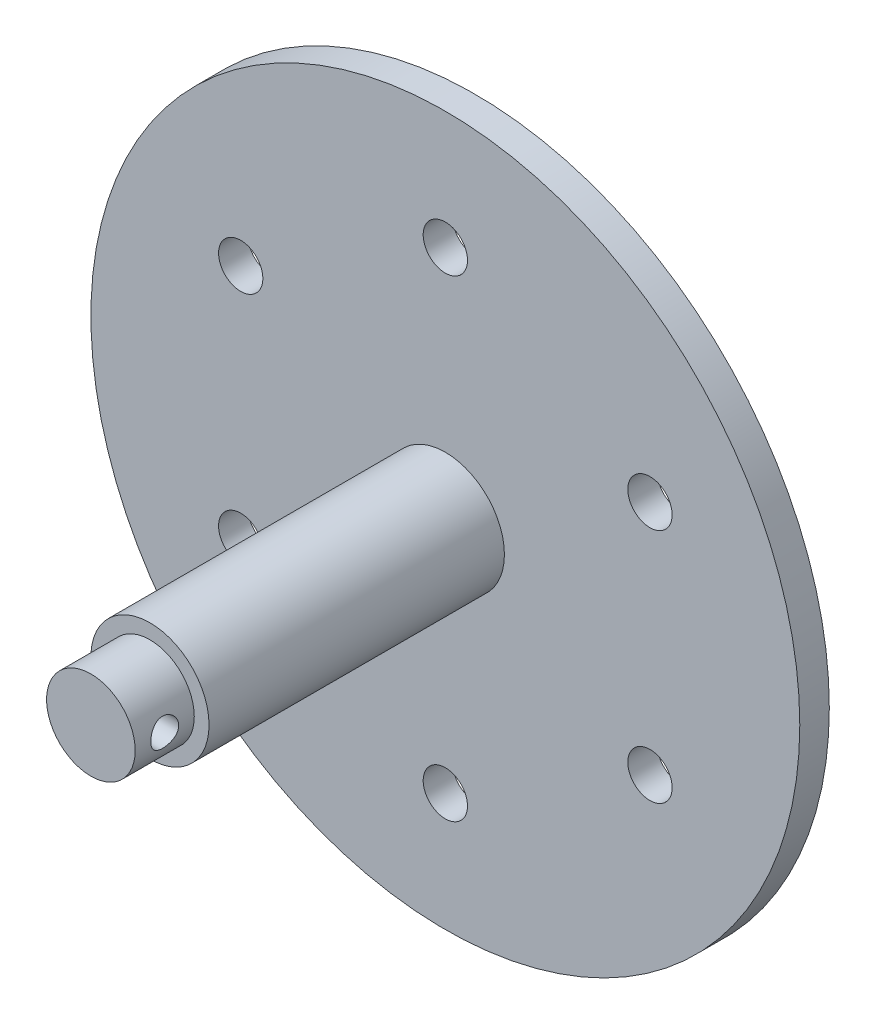
ISO-10303-21;
HEADER;
FILE_DESCRIPTION(('STEP AP214'),'2;1');
FILE_NAME('part.step','',(''),(''),'','','');
FILE_SCHEMA(('AUTOMOTIVE_DESIGN { 1 0 10303 214 1 1 1 1 }'));
ENDSEC;
DATA;
#1=APPLICATION_CONTEXT('core data for automotive mechanical design processes');
#2=APPLICATION_PROTOCOL_DEFINITION('international standard','automotive_design',2000,#1);
#3=PRODUCT_CONTEXT('',#1,'mechanical');
#4=PRODUCT('Part','Part','',(#3));
#5=PRODUCT_RELATED_PRODUCT_CATEGORY('part','',(#4));
#6=PRODUCT_DEFINITION_FORMATION('','',#4);
#7=PRODUCT_DEFINITION_CONTEXT('part definition',#1,'design');
#8=PRODUCT_DEFINITION('design','',#6,#7);
#9=PRODUCT_DEFINITION_SHAPE('','',#8);
#10=(LENGTH_UNIT() NAMED_UNIT(*) SI_UNIT(.MILLI.,.METRE.));
#11=(NAMED_UNIT(*) PLANE_ANGLE_UNIT() SI_UNIT($,.RADIAN.));
#12=(NAMED_UNIT(*) SI_UNIT($,.STERADIAN.) SOLID_ANGLE_UNIT());
#13=UNCERTAINTY_MEASURE_WITH_UNIT(LENGTH_MEASURE(1.E-05),#10,'distance_accuracy_value','');
#14=(GEOMETRIC_REPRESENTATION_CONTEXT(3) GLOBAL_UNCERTAINTY_ASSIGNED_CONTEXT((#13)) GLOBAL_UNIT_ASSIGNED_CONTEXT((#10,
#11,#12)) REPRESENTATION_CONTEXT('',''));
#15=CARTESIAN_POINT('',(0.,0.,0.));
#16=DIRECTION('',(0.,0.,1.));
#17=DIRECTION('',(1.,0.,0.));
#18=AXIS2_PLACEMENT_3D('',#15,#16,#17);
#19=CARTESIAN_POINT('',(0.,0.,82.55));
#20=DIRECTION('',(0.,0.,-1.));
#21=DIRECTION('',(-1.,0.,0.));
#22=AXIS2_PLACEMENT_3D('',#19,#20,#21);
#23=CYLINDRICAL_SURFACE('',#22,12.7);
#24=CARTESIAN_POINT('',(0.,0.,6.35));
#25=DIRECTION('',(0.,0.,1.));
#26=DIRECTION('',(1.,0.,0.));
#27=AXIS2_PLACEMENT_3D('',#24,#25,#26);
#28=CIRCLE('',#27,12.7);
#29=CARTESIAN_POINT('',(12.7,0.,6.35));
#30=VERTEX_POINT('',#29);
#31=EDGE_CURVE('E141',#30,#30,#28,.T.);
#32=ORIENTED_EDGE('',*,*,#31,.T.);
#33=EDGE_LOOP('',(#32));
#34=FACE_BOUND('',#33,.T.);
#35=CARTESIAN_POINT('',(0.,0.,69.85));
#36=DIRECTION('',(0.,0.,1.));
#37=DIRECTION('',(1.,0.,0.));
#38=AXIS2_PLACEMENT_3D('',#35,#36,#37);
#39=CIRCLE('',#38,12.7);
#40=CARTESIAN_POINT('',(12.7,0.,69.85));
#41=VERTEX_POINT('',#40);
#42=EDGE_CURVE('E194',#41,#41,#39,.T.);
#43=ORIENTED_EDGE('',*,*,#42,.F.);
#44=EDGE_LOOP('',(#43));
#45=FACE_BOUND('',#44,.T.);
#46=ADVANCED_FACE('F44',(#34,#45),#23,.T.);
#47=CARTESIAN_POINT('',(-43.9940905122452,-25.4000000000025,6.35));
#48=DIRECTION('',(0.,0.,-1.));
#49=DIRECTION('',(-1.,0.,0.));
#50=AXIS2_PLACEMENT_3D('',#47,#48,#49);
#51=CYLINDRICAL_SURFACE('',#50,4.76250000000533);
#52=CARTESIAN_POINT('',(-43.9940905122452,-25.4000000000025,6.35));
#53=DIRECTION('',(0.,0.,1.));
#54=DIRECTION('',(1.,0.,0.));
#55=AXIS2_PLACEMENT_3D('',#52,#53,#54);
#56=CIRCLE('',#55,4.76250000000533);
#57=CARTESIAN_POINT('',(-39.2315905122398,-25.4000000000025,6.35));
#58=VERTEX_POINT('',#57);
#59=EDGE_CURVE('E61',#58,#58,#56,.T.);
#60=ORIENTED_EDGE('',*,*,#59,.T.);
#61=EDGE_LOOP('',(#60));
#62=FACE_BOUND('',#61,.T.);
#63=CARTESIAN_POINT('',(-43.9940905122452,-25.4000000000025,0.));
#64=DIRECTION('',(0.,0.,1.));
#65=DIRECTION('',(1.,0.,0.));
#66=AXIS2_PLACEMENT_3D('',#63,#64,#65);
#67=CIRCLE('',#66,4.76250000000533);
#68=CARTESIAN_POINT('',(-39.2315905122398,-25.4000000000025,0.));
#69=VERTEX_POINT('',#68);
#70=EDGE_CURVE('E148',#69,#69,#67,.T.);
#71=ORIENTED_EDGE('',*,*,#70,.F.);
#72=EDGE_LOOP('',(#71));
#73=FACE_BOUND('',#72,.T.);
#74=ADVANCED_FACE('F84',(#62,#73),#51,.F.);
#75=CARTESIAN_POINT('',(5.76284894477876E-12,-50.8,6.35));
#76=DIRECTION('',(0.,0.,-1.));
#77=DIRECTION('',(-1.,0.,0.));
#78=AXIS2_PLACEMENT_3D('',#75,#76,#77);
#79=CYLINDRICAL_SURFACE('',#78,4.76250000000585);
#80=CARTESIAN_POINT('',(5.76284894477876E-12,-50.8,6.35));
#81=DIRECTION('',(0.,0.,1.));
#82=DIRECTION('',(1.,0.,0.));
#83=AXIS2_PLACEMENT_3D('',#80,#81,#82);
#84=CIRCLE('',#83,4.76250000000585);
#85=CARTESIAN_POINT('',(4.76250000001161,-50.8,6.35));
#86=VERTEX_POINT('',#85);
#87=EDGE_CURVE('E169',#86,#86,#84,.T.);
#88=ORIENTED_EDGE('',*,*,#87,.T.);
#89=EDGE_LOOP('',(#88));
#90=FACE_BOUND('',#89,.T.);
#91=CARTESIAN_POINT('',(5.76284894477876E-12,-50.8,0.));
#92=DIRECTION('',(0.,0.,1.));
#93=DIRECTION('',(1.,0.,0.));
#94=AXIS2_PLACEMENT_3D('',#91,#92,#93);
#95=CIRCLE('',#94,4.76250000000585);
#96=CARTESIAN_POINT('',(4.76250000001161,-50.8,0.));
#97=VERTEX_POINT('',#96);
#98=EDGE_CURVE('E146',#97,#97,#95,.T.);
#99=ORIENTED_EDGE('',*,*,#98,.F.);
#100=EDGE_LOOP('',(#99));
#101=FACE_BOUND('',#100,.T.);
#102=ADVANCED_FACE('F90',(#90,#101),#79,.F.);
#103=CARTESIAN_POINT('',(43.9940905122538,-25.3999999999975,6.35));
#104=DIRECTION('',(0.,0.,-1.));
#105=DIRECTION('',(-1.,0.,0.));
#106=AXIS2_PLACEMENT_3D('',#103,#104,#105);
#107=CYLINDRICAL_SURFACE('',#106,4.76250000000363);
#108=CARTESIAN_POINT('',(43.9940905122538,-25.3999999999975,6.35));
#109=DIRECTION('',(0.,0.,1.));
#110=DIRECTION('',(1.,0.,0.));
#111=AXIS2_PLACEMENT_3D('',#108,#109,#110);
#112=CIRCLE('',#111,4.76250000000363);
#113=CARTESIAN_POINT('',(48.7565905122574,-25.3999999999975,6.35));
#114=VERTEX_POINT('',#113);
#115=EDGE_CURVE('E166',#114,#114,#112,.T.);
#116=ORIENTED_EDGE('',*,*,#115,.T.);
#117=EDGE_LOOP('',(#116));
#118=FACE_BOUND('',#117,.T.);
#119=CARTESIAN_POINT('',(43.9940905122538,-25.3999999999975,0.));
#120=DIRECTION('',(0.,0.,1.));
#121=DIRECTION('',(1.,0.,0.));
#122=AXIS2_PLACEMENT_3D('',#119,#120,#121);
#123=CIRCLE('',#122,4.76250000000363);
#124=CARTESIAN_POINT('',(48.7565905122574,-25.3999999999975,0.));
#125=VERTEX_POINT('',#124);
#126=EDGE_CURVE('E138',#125,#125,#123,.T.);
#127=ORIENTED_EDGE('',*,*,#126,.F.);
#128=EDGE_LOOP('',(#127));
#129=FACE_BOUND('',#128,.T.);
#130=ADVANCED_FACE('F111',(#118,#129),#107,.F.);
#131=CARTESIAN_POINT('',(43.9940905122509,25.4000000000025,6.35));
#132=DIRECTION('',(0.,0.,-1.));
#133=DIRECTION('',(-1.,0.,0.));
#134=AXIS2_PLACEMENT_3D('',#131,#132,#133);
#135=CYLINDRICAL_SURFACE('',#134,4.76250000000077);
#136=CARTESIAN_POINT('',(43.9940905122509,25.4000000000025,6.35));
#137=DIRECTION('',(0.,0.,1.));
#138=DIRECTION('',(1.,0.,0.));
#139=AXIS2_PLACEMENT_3D('',#136,#137,#138);
#140=CIRCLE('',#139,4.76250000000077);
#141=CARTESIAN_POINT('',(48.7565905122517,25.4000000000025,6.35));
#142=VERTEX_POINT('',#141);
#143=EDGE_CURVE('E159',#142,#142,#140,.T.);
#144=ORIENTED_EDGE('',*,*,#143,.T.);
#145=EDGE_LOOP('',(#144));
#146=FACE_BOUND('',#145,.T.);
#147=CARTESIAN_POINT('',(43.9940905122509,25.4000000000025,0.));
#148=DIRECTION('',(0.,0.,1.));
#149=DIRECTION('',(1.,0.,0.));
#150=AXIS2_PLACEMENT_3D('',#147,#148,#149);
#151=CIRCLE('',#150,4.76250000000077);
#152=CARTESIAN_POINT('',(48.7565905122517,25.4000000000025,0.));
#153=VERTEX_POINT('',#152);
#154=EDGE_CURVE('E134',#153,#153,#151,.T.);
#155=ORIENTED_EDGE('',*,*,#154,.F.);
#156=EDGE_LOOP('',(#155));
#157=FACE_BOUND('',#156,.T.);
#158=ADVANCED_FACE('F115',(#146,#157),#135,.F.);
#159=CARTESIAN_POINT('',(0.,50.8,6.35));
#160=DIRECTION('',(0.,0.,-1.));
#161=DIRECTION('',(-1.,0.,0.));
#162=AXIS2_PLACEMENT_3D('',#159,#160,#161);
#163=CYLINDRICAL_SURFACE('',#162,4.7625);
#164=CARTESIAN_POINT('',(0.,50.8,6.35));
#165=DIRECTION('',(0.,0.,1.));
#166=DIRECTION('',(1.,0.,0.));
#167=AXIS2_PLACEMENT_3D('',#164,#165,#166);
#168=CIRCLE('',#167,4.7625);
#169=CARTESIAN_POINT('',(4.7625,50.8,6.35));
#170=VERTEX_POINT('',#169);
#171=EDGE_CURVE('E129',#170,#170,#168,.T.);
#172=ORIENTED_EDGE('',*,*,#171,.T.);
#173=EDGE_LOOP('',(#172));
#174=FACE_BOUND('',#173,.T.);
#175=CARTESIAN_POINT('',(0.,50.8,0.));
#176=DIRECTION('',(0.,0.,1.));
#177=DIRECTION('',(1.,0.,0.));
#178=AXIS2_PLACEMENT_3D('',#175,#176,#177);
#179=CIRCLE('',#178,4.7625);
#180=CARTESIAN_POINT('',(4.7625,50.8,0.));
#181=VERTEX_POINT('',#180);
#182=EDGE_CURVE('E132',#181,#181,#179,.T.);
#183=ORIENTED_EDGE('',*,*,#182,.F.);
#184=EDGE_LOOP('',(#183));
#185=FACE_BOUND('',#184,.T.);
#186=ADVANCED_FACE('F118',(#174,#185),#163,.F.);
#187=CARTESIAN_POINT('',(-43.9940905122481,25.3999999999975,6.35));
#188=DIRECTION('',(0.,0.,-1.));
#189=DIRECTION('',(-1.,0.,0.));
#190=AXIS2_PLACEMENT_3D('',#187,#188,#189);
#191=CYLINDRICAL_SURFACE('',#190,4.76250000000271);
#192=CARTESIAN_POINT('',(-43.9940905122481,25.3999999999975,6.35));
#193=DIRECTION('',(0.,0.,1.));
#194=DIRECTION('',(1.,0.,0.));
#195=AXIS2_PLACEMENT_3D('',#192,#193,#194);
#196=CIRCLE('',#195,4.76250000000271);
#197=CARTESIAN_POINT('',(-39.2315905122454,25.3999999999975,6.35));
#198=VERTEX_POINT('',#197);
#199=EDGE_CURVE('E153',#198,#198,#196,.T.);
#200=ORIENTED_EDGE('',*,*,#199,.T.);
#201=EDGE_LOOP('',(#200));
#202=FACE_BOUND('',#201,.T.);
#203=CARTESIAN_POINT('',(-43.9940905122481,25.3999999999975,0.));
#204=DIRECTION('',(0.,0.,1.));
#205=DIRECTION('',(1.,0.,0.));
#206=AXIS2_PLACEMENT_3D('',#203,#204,#205);
#207=CIRCLE('',#206,4.76250000000271);
#208=CARTESIAN_POINT('',(-39.2315905122454,25.3999999999975,0.));
#209=VERTEX_POINT('',#208);
#210=EDGE_CURVE('E135',#209,#209,#207,.T.);
#211=ORIENTED_EDGE('',*,*,#210,.F.);
#212=EDGE_LOOP('',(#211));
#213=FACE_BOUND('',#212,.T.);
#214=ADVANCED_FACE('F46',(#202,#213),#191,.F.);
#215=CARTESIAN_POINT('',(0.,0.,6.35));
#216=DIRECTION('',(0.,0.,-1.));
#217=DIRECTION('',(-1.,0.,0.));
#218=AXIS2_PLACEMENT_3D('',#215,#216,#217);
#219=CYLINDRICAL_SURFACE('',#218,76.2);
#220=CARTESIAN_POINT('',(0.,0.,6.35));
#221=DIRECTION('',(0.,0.,1.));
#222=DIRECTION('',(1.,0.,0.));
#223=AXIS2_PLACEMENT_3D('',#220,#221,#222);
#224=CIRCLE('',#223,76.2);
#225=CARTESIAN_POINT('',(76.2,0.,6.35));
#226=VERTEX_POINT('',#225);
#227=EDGE_CURVE('E57',#226,#226,#224,.T.);
#228=ORIENTED_EDGE('',*,*,#227,.F.);
#229=EDGE_LOOP('',(#228));
#230=FACE_BOUND('',#229,.T.);
#231=CARTESIAN_POINT('',(0.,0.,0.));
#232=DIRECTION('',(0.,0.,1.));
#233=DIRECTION('',(1.,0.,0.));
#234=AXIS2_PLACEMENT_3D('',#231,#232,#233);
#235=CIRCLE('',#234,76.2);
#236=CARTESIAN_POINT('',(76.2,0.,0.));
#237=VERTEX_POINT('',#236);
#238=EDGE_CURVE('E67',#237,#237,#235,.T.);
#239=ORIENTED_EDGE('',*,*,#238,.T.);
#240=EDGE_LOOP('',(#239));
#241=FACE_BOUND('',#240,.T.);
#242=ADVANCED_FACE('F100',(#230,#241),#219,.T.);
#243=CARTESIAN_POINT('',(0.,0.,6.35));
#244=DIRECTION('',(0.,0.,1.));
#245=DIRECTION('',(1.,0.,0.));
#246=AXIS2_PLACEMENT_3D('',#243,#244,#245);
#247=PLANE('',#246);
#248=ORIENTED_EDGE('',*,*,#31,.F.);
#249=EDGE_LOOP('',(#248));
#250=FACE_BOUND('',#249,.T.);
#251=ORIENTED_EDGE('',*,*,#199,.F.);
#252=EDGE_LOOP('',(#251));
#253=FACE_BOUND('',#252,.T.);
#254=ORIENTED_EDGE('',*,*,#171,.F.);
#255=EDGE_LOOP('',(#254));
#256=FACE_BOUND('',#255,.T.);
#257=ORIENTED_EDGE('',*,*,#143,.F.);
#258=EDGE_LOOP('',(#257));
#259=FACE_BOUND('',#258,.T.);
#260=ORIENTED_EDGE('',*,*,#115,.F.);
#261=EDGE_LOOP('',(#260));
#262=FACE_BOUND('',#261,.T.);
#263=ORIENTED_EDGE('',*,*,#87,.F.);
#264=EDGE_LOOP('',(#263));
#265=FACE_BOUND('',#264,.T.);
#266=ORIENTED_EDGE('',*,*,#59,.F.);
#267=EDGE_LOOP('',(#266));
#268=FACE_BOUND('',#267,.T.);
#269=ORIENTED_EDGE('',*,*,#227,.T.);
#270=EDGE_LOOP('',(#269));
#271=FACE_BOUND('',#270,.T.);
#272=ADVANCED_FACE('F96',(#250,#253,#256,#259,#262,#265,#268,#271),#247,.T.);
#273=CARTESIAN_POINT('',(0.,0.,0.));
#274=DIRECTION('',(0.,0.,1.));
#275=DIRECTION('',(1.,0.,0.));
#276=AXIS2_PLACEMENT_3D('',#273,#274,#275);
#277=PLANE('',#276);
#278=ORIENTED_EDGE('',*,*,#210,.T.);
#279=EDGE_LOOP('',(#278));
#280=FACE_BOUND('',#279,.T.);
#281=ORIENTED_EDGE('',*,*,#182,.T.);
#282=EDGE_LOOP('',(#281));
#283=FACE_BOUND('',#282,.T.);
#284=ORIENTED_EDGE('',*,*,#154,.T.);
#285=EDGE_LOOP('',(#284));
#286=FACE_BOUND('',#285,.T.);
#287=ORIENTED_EDGE('',*,*,#126,.T.);
#288=EDGE_LOOP('',(#287));
#289=FACE_BOUND('',#288,.T.);
#290=ORIENTED_EDGE('',*,*,#98,.T.);
#291=EDGE_LOOP('',(#290));
#292=FACE_BOUND('',#291,.T.);
#293=ORIENTED_EDGE('',*,*,#70,.T.);
#294=EDGE_LOOP('',(#293));
#295=FACE_BOUND('',#294,.T.);
#296=ORIENTED_EDGE('',*,*,#238,.F.);
#297=EDGE_LOOP('',(#296));
#298=FACE_BOUND('',#297,.T.);
#299=ADVANCED_FACE('F99',(#280,#283,#286,#289,#292,#295,#298),#277,.F.);
#300=CARTESIAN_POINT('',(0.,0.,69.85));
#301=DIRECTION('',(0.,0.,1.));
#302=DIRECTION('',(1.,0.,0.));
#303=AXIS2_PLACEMENT_3D('',#300,#301,#302);
#304=PLANE('',#303);
#305=CARTESIAN_POINT('',(0.,0.,69.85));
#306=DIRECTION('',(0.,0.,1.));
#307=DIRECTION('',(1.,0.,0.));
#308=AXIS2_PLACEMENT_3D('',#305,#306,#307);
#309=CIRCLE('',#308,9.525);
#310=CARTESIAN_POINT('',(9.525,0.,69.85));
#311=VERTEX_POINT('',#310);
#312=EDGE_CURVE('E197',#311,#311,#309,.T.);
#313=ORIENTED_EDGE('',*,*,#312,.F.);
#314=EDGE_LOOP('',(#313));
#315=FACE_BOUND('',#314,.T.);
#316=ORIENTED_EDGE('',*,*,#42,.T.);
#317=EDGE_LOOP('',(#316));
#318=FACE_BOUND('',#317,.T.);
#319=ADVANCED_FACE('F104',(#315,#318),#304,.T.);
#320=CARTESIAN_POINT('',(0.,0.,69.85));
#321=DIRECTION('',(0.,0.,1.));
#322=DIRECTION('',(1.,0.,0.));
#323=AXIS2_PLACEMENT_3D('',#320,#321,#322);
#324=CYLINDRICAL_SURFACE('',#323,9.525);
#325=CARTESIAN_POINT('',(-9.525,0.,73.2));
#326=CARTESIAN_POINT('',(-9.52499931266081,-0.164189073814362,73.2000008753242));
#327=CARTESIAN_POINT('',(-9.52071466981749,-0.328387574939974,73.2135233806524));
#328=CARTESIAN_POINT('',(-9.5040424103461,-0.651978710683436,73.2671116237369));
#329=CARTESIAN_POINT('',(-9.49165307563722,-0.811370318811275,73.3071829895019));
#330=CARTESIAN_POINT('',(-9.46012404835796,-1.12063481348671,73.4123807410935));
#331=CARTESIAN_POINT('',(-9.44099490570975,-1.27052214701032,73.4774679835788));
#332=CARTESIAN_POINT('',(-9.3979587516853,-1.55725526749612,73.6306821604155));
#333=CARTESIAN_POINT('',(-9.37405096475095,-1.69409893218291,73.7188128353559));
#334=CARTESIAN_POINT('',(-9.32315525697173,-1.95514677028046,73.9185170418085));
#335=CARTESIAN_POINT('',(-9.29609944541218,-2.07888517641784,74.0306820395342));
#336=CARTESIAN_POINT('',(-9.24234796761949,-2.3061424775051,74.2740118086495));
#337=CARTESIAN_POINT('',(-9.21565237067662,-2.40965753252159,74.4051801801094));
#338=CARTESIAN_POINT('',(-9.16491330354245,-2.5960704511318,74.6868439406425));
#339=CARTESIAN_POINT('',(-9.140953507366,-2.67838375142392,74.8377427158424));
#340=CARTESIAN_POINT('',(-9.09942125524848,-2.8162707913895,75.1521179799061));
#341=CARTESIAN_POINT('',(-9.08184708678103,-2.87185170157181,75.3155910822589));
#342=CARTESIAN_POINT('',(-9.05578658453695,-2.9529869586775,75.6452138513171));
#343=CARTESIAN_POINT('',(-9.04703914031255,-2.97940634160216,75.8111293701226));
#344=CARTESIAN_POINT('',(-9.03884758106721,-3.00417130833937,76.145250842403));
#345=CARTESIAN_POINT('',(-9.03940094775781,-3.0025244913572,76.3134561635666));
#346=CARTESIAN_POINT('',(-9.04951819732511,-2.9718798091447,76.6402019438145));
#347=CARTESIAN_POINT('',(-9.0587187125602,-2.9439848780744,76.7988589968918));
#348=CARTESIAN_POINT('',(-9.08450279968715,-2.86342532060654,77.1091154014283));
#349=CARTESIAN_POINT('',(-9.1010871675485,-2.81075802374641,77.2607139900479));
#350=CARTESIAN_POINT('',(-9.14004652730535,-2.68137651119333,77.5551634962185));
#351=CARTESIAN_POINT('',(-9.16250351693176,-2.60431823803926,77.6978519190191));
#352=CARTESIAN_POINT('',(-9.21064058660276,-2.42858109971761,77.9686330822521));
#353=CARTESIAN_POINT('',(-9.23632151421635,-2.32989654392343,78.0967219675282));
#354=CARTESIAN_POINT('',(-9.28946736591698,-2.10830922081832,78.3408991848391));
#355=CARTESIAN_POINT('',(-9.31695984644805,-1.98449693707153,78.4561576843856));
#356=CARTESIAN_POINT('',(-9.36958375529292,-1.71895931590884,78.6644791140118));
#357=CARTESIAN_POINT('',(-9.39471500302899,-1.57723261040977,78.7575403473687));
#358=CARTESIAN_POINT('',(-9.4400559475988,-1.27827158141397,78.9193998140694));
#359=CARTESIAN_POINT('',(-9.46022452608442,-1.12092192555227,78.9879973221887));
#360=CARTESIAN_POINT('',(-9.49307070383391,-0.796133097856621,79.0975017808442));
#361=CARTESIAN_POINT('',(-9.50575061500346,-0.628697057506709,79.1384172779552));
#362=CARTESIAN_POINT('',(-9.52181749362888,-0.295530026753034,79.1899762017319));
#363=CARTESIAN_POINT('',(-9.5255490614962,-0.129989214180609,79.2017427737424));
#364=CARTESIAN_POINT('',(-9.52431962660261,0.20072088954306,79.1978402978302));
#365=CARTESIAN_POINT('',(-9.51935991598327,0.365890232265758,79.1821753281841));
#366=CARTESIAN_POINT('',(-9.50153177954153,0.68681795668319,79.1247546921918));
#367=CARTESIAN_POINT('',(-9.4888668032475,0.842708736164694,79.0836697549067));
#368=CARTESIAN_POINT('',(-9.45711344167471,1.14533868968436,78.97739617255));
#369=CARTESIAN_POINT('',(-9.43802425944073,1.29207672559999,78.9122045368214));
#370=CARTESIAN_POINT('',(-9.39479784458182,1.5762546180905,78.7577756284438));
#371=CARTESIAN_POINT('',(-9.3705479105105,1.71337665230169,78.6679859222977));
#372=CARTESIAN_POINT('',(-9.31977037713467,1.97098249471826,78.4675708225418));
#373=CARTESIAN_POINT('',(-9.29324215195269,2.09146170705151,78.356939693484));
#374=CARTESIAN_POINT('',(-9.23955147061776,2.31740244399266,78.1126990452469));
#375=CARTESIAN_POINT('',(-9.2124065274441,2.422063279717,77.9783432816237));
#376=CARTESIAN_POINT('',(-9.16167072694386,2.60742825051034,77.6933863752275));
#377=CARTESIAN_POINT('',(-9.13807982163924,2.68813270899486,77.5427854518046));
#378=CARTESIAN_POINT('',(-9.0973820573651,2.82280458822619,77.229886163499));
#379=CARTESIAN_POINT('',(-9.08025132736603,2.87687067227774,77.0676335533253));
#380=CARTESIAN_POINT('',(-9.05457087767927,2.95671515157192,76.7356755554324));
#381=CARTESIAN_POINT('',(-9.04601782584547,2.98250453174837,76.565973088499));
#382=CARTESIAN_POINT('',(-9.03881207827915,3.00426659055819,76.2323136752505));
#383=CARTESIAN_POINT('',(-9.03972264620182,3.00155451518256,76.0684508962483));
#384=CARTESIAN_POINT('',(-9.05027840949364,2.96957283277759,75.7436390811317));
#385=CARTESIAN_POINT('',(-9.05992318524209,2.94030450159993,75.5826899054168));
#386=CARTESIAN_POINT('',(-9.08655308572861,2.85692762015734,75.2706668404106));
#387=CARTESIAN_POINT('',(-9.10342508926708,2.80320110985145,75.1194804779127));
#388=CARTESIAN_POINT('',(-9.14257795897905,2.67273467980761,74.8281477654328));
#389=CARTESIAN_POINT('',(-9.16485993761035,2.59599002606431,74.6880036939471));
#390=CARTESIAN_POINT('',(-9.21342444723679,2.4181075015467,74.4167169967216));
#391=CARTESIAN_POINT('',(-9.23983058020514,2.31612300915843,74.2861516926645));
#392=CARTESIAN_POINT('',(-9.29310573599393,2.09213872184333,74.0435622588752));
#393=CARTESIAN_POINT('',(-9.31997488166127,1.97013353948994,73.9315431361342));
#394=CARTESIAN_POINT('',(-9.37222395746739,1.70467534361656,73.7254821162262));
#395=CARTESIAN_POINT('',(-9.39752431026903,1.56064263018052,73.6321645632307));
#396=CARTESIAN_POINT('',(-9.4427774975764,1.25813863848706,73.4711881785927));
#397=CARTESIAN_POINT('',(-9.46273235132965,1.09967284268407,73.4035196540808));
#398=CARTESIAN_POINT('',(-9.49372665833407,0.785886126884941,73.30044178346));
#399=CARTESIAN_POINT('',(-9.50535131635795,0.631326571443622,73.2628859658507));
#400=CARTESIAN_POINT('',(-9.52098752033993,0.317847006302182,73.2126672646809));
#401=CARTESIAN_POINT('',(-9.52500066531459,0.158927919564715,73.199999152724));
#402=CARTESIAN_POINT('',(-9.525,0.,73.2));
#403=B_SPLINE_CURVE_WITH_KNOTS('',3,(#325,#326,#327,#328,#329,#330,#331,#332,#333,#334,#335,
#336,#337,#338,#339,#340,#341,#342,#343,#344,#345,#346,#347,#348,#349,#350,#351,#352,#353,#354,
#355,#356,#357,#358,#359,#360,#361,#362,#363,#364,#365,#366,#367,#368,#369,#370,#371,#372,#373,
#374,#375,#376,#377,#378,#379,#380,#381,#382,#383,#384,#385,#386,#387,#388,#389,#390,#391,#392,
#393,#394,#395,#396,#397,#398,#399,#400,#401,#402),.UNSPECIFIED.,.T.,.F.,(4,2,2,2,2,2,2,2,2,2,2,
2,2,2,2,2,2,2,2,2,2,2,2,2,2,2,2,2,2,2,2,2,2,2,2,2,2,2,4),(0.,0.491982975837012,
0.984070278964415,1.47539070775962,1.96679094107314,2.47206097109461,2.97742684683317,
3.49551373678612,4.01346158113521,4.51559393148096,5.0175903266143,5.49939257222292,
5.98124676805157,6.47022596317315,6.9593339805418,7.47107999154016,7.98286510704198,
8.49875772425916,9.01449099144444,9.51001985138918,10.0054750467844,10.4883840307967,
10.9713529442058,11.4662112880626,11.9612060137504,12.4761451630775,12.9910773603149,
13.5040877376452,14.0168987500168,14.5061531902446,14.9953841262912,15.4772223657458,
15.9591597700499,16.4602081657333,16.9613916117741,17.4792937303893,17.9969999361485,
18.4733182457815,18.9495364800072),.UNSPECIFIED.);
#404=CARTESIAN_POINT('',(-9.525,0.,73.2));
#405=VERTEX_POINT('',#404);
#406=EDGE_CURVE('E48',#405,#405,#403,.T.);
#407=ORIENTED_EDGE('',*,*,#406,.F.);
#408=EDGE_LOOP('',(#407));
#409=FACE_BOUND('',#408,.T.);
#410=CARTESIAN_POINT('',(9.52500000000001,0.,73.2));
#411=CARTESIAN_POINT('',(9.52499931266082,0.164189073814362,73.2000008753242));
#412=CARTESIAN_POINT('',(9.5207146698175,0.328387574939974,73.2135233806524));
#413=CARTESIAN_POINT('',(9.5040424103461,0.651978710683435,73.2671116237369));
#414=CARTESIAN_POINT('',(9.49165307563722,0.811370318811275,73.3071829895019));
#415=CARTESIAN_POINT('',(9.46012404835796,1.12063481348671,73.4123807410935));
#416=CARTESIAN_POINT('',(9.44099490570975,1.27052214701032,73.4774679835788));
#417=CARTESIAN_POINT('',(9.3979587516853,1.55725526749612,73.6306821604155));
#418=CARTESIAN_POINT('',(9.37405096475095,1.69409893218291,73.7188128353559));
#419=CARTESIAN_POINT('',(9.32315525697173,1.95514677028046,73.9185170418085));
#420=CARTESIAN_POINT('',(9.29609944541218,2.07888517641784,74.0306820395342));
#421=CARTESIAN_POINT('',(9.24234796761949,2.3061424775051,74.2740118086495));
#422=CARTESIAN_POINT('',(9.21565237067662,2.40965753252159,74.4051801801094));
#423=CARTESIAN_POINT('',(9.16491330354245,2.5960704511318,74.6868439406425));
#424=CARTESIAN_POINT('',(9.140953507366,2.67838375142392,74.8377427158424));
#425=CARTESIAN_POINT('',(9.09942125524848,2.8162707913895,75.1521179799061));
#426=CARTESIAN_POINT('',(9.08184708678103,2.87185170157181,75.3155910822589));
#427=CARTESIAN_POINT('',(9.05578658453695,2.9529869586775,75.6452138513171));
#428=CARTESIAN_POINT('',(9.04703914031255,2.97940634160216,75.8111293701226));
#429=CARTESIAN_POINT('',(9.03884758106721,3.00417130833937,76.145250842403));
#430=CARTESIAN_POINT('',(9.03940094775781,3.0025244913572,76.3134561635666));
#431=CARTESIAN_POINT('',(9.04951819732511,2.9718798091447,76.6402019438145));
#432=CARTESIAN_POINT('',(9.0587187125602,2.9439848780744,76.7988589968918));
#433=CARTESIAN_POINT('',(9.08450279968715,2.86342532060654,77.1091154014283));
#434=CARTESIAN_POINT('',(9.1010871675485,2.81075802374641,77.2607139900479));
#435=CARTESIAN_POINT('',(9.14004652730535,2.68137651119333,77.5551634962185));
#436=CARTESIAN_POINT('',(9.16250351693176,2.60431823803926,77.6978519190191));
#437=CARTESIAN_POINT('',(9.21064058660276,2.42858109971761,77.9686330822521));
#438=CARTESIAN_POINT('',(9.23632151421635,2.32989654392343,78.0967219675282));
#439=CARTESIAN_POINT('',(9.28946736591698,2.10830922081832,78.3408991848391));
#440=CARTESIAN_POINT('',(9.31695984644805,1.98449693707153,78.4561576843856));
#441=CARTESIAN_POINT('',(9.36958375529292,1.71895931590884,78.6644791140118));
#442=CARTESIAN_POINT('',(9.39471500302899,1.57723261040977,78.7575403473687));
#443=CARTESIAN_POINT('',(9.4400559475988,1.27827158141397,78.9193998140694));
#444=CARTESIAN_POINT('',(9.46022452608442,1.12092192555227,78.9879973221887));
#445=CARTESIAN_POINT('',(9.49307070383391,0.796133097856621,79.0975017808442));
#446=CARTESIAN_POINT('',(9.50575061500346,0.628697057506709,79.1384172779552));
#447=CARTESIAN_POINT('',(9.52181749362888,0.295530026753034,79.1899762017319));
#448=CARTESIAN_POINT('',(9.5255490614962,0.129989214180609,79.2017427737424));
#449=CARTESIAN_POINT('',(9.52431962660261,-0.20072088954306,79.1978402978302));
#450=CARTESIAN_POINT('',(9.51935991598327,-0.365890232265758,79.1821753281841));
#451=CARTESIAN_POINT('',(9.50153177954153,-0.68681795668319,79.1247546921918));
#452=CARTESIAN_POINT('',(9.4888668032475,-0.842708736164694,79.0836697549067));
#453=CARTESIAN_POINT('',(9.45711344167471,-1.14533868968436,78.97739617255));
#454=CARTESIAN_POINT('',(9.43802425944073,-1.29207672559999,78.9122045368214));
#455=CARTESIAN_POINT('',(9.39479784458182,-1.5762546180905,78.7577756284438));
#456=CARTESIAN_POINT('',(9.3705479105105,-1.71337665230169,78.6679859222977));
#457=CARTESIAN_POINT('',(9.31977037713467,-1.97098249471826,78.4675708225418));
#458=CARTESIAN_POINT('',(9.29324215195269,-2.09146170705151,78.356939693484));
#459=CARTESIAN_POINT('',(9.23955147061776,-2.31740244399266,78.1126990452469));
#460=CARTESIAN_POINT('',(9.2124065274441,-2.422063279717,77.9783432816237));
#461=CARTESIAN_POINT('',(9.16167072694386,-2.60742825051034,77.6933863752275));
#462=CARTESIAN_POINT('',(9.13807982163924,-2.68813270899486,77.5427854518046));
#463=CARTESIAN_POINT('',(9.0973820573651,-2.82280458822619,77.229886163499));
#464=CARTESIAN_POINT('',(9.08025132736603,-2.87687067227774,77.0676335533253));
#465=CARTESIAN_POINT('',(9.05457087767927,-2.95671515157192,76.7356755554324));
#466=CARTESIAN_POINT('',(9.04601782584547,-2.98250453174837,76.565973088499));
#467=CARTESIAN_POINT('',(9.03881207827915,-3.00426659055819,76.2323136752505));
#468=CARTESIAN_POINT('',(9.03972264620182,-3.00155451518256,76.0684508962483));
#469=CARTESIAN_POINT('',(9.05027840949364,-2.96957283277759,75.7436390811317));
#470=CARTESIAN_POINT('',(9.05992318524209,-2.94030450159993,75.5826899054168));
#471=CARTESIAN_POINT('',(9.08655308572861,-2.85692762015734,75.2706668404106));
#472=CARTESIAN_POINT('',(9.10342508926708,-2.80320110985145,75.1194804779127));
#473=CARTESIAN_POINT('',(9.14257795897905,-2.67273467980761,74.8281477654328));
#474=CARTESIAN_POINT('',(9.16485993761035,-2.59599002606431,74.6880036939471));
#475=CARTESIAN_POINT('',(9.21342444723679,-2.4181075015467,74.4167169967216));
#476=CARTESIAN_POINT('',(9.23983058020514,-2.31612300915843,74.2861516926645));
#477=CARTESIAN_POINT('',(9.29310573599393,-2.09213872184333,74.0435622588752));
#478=CARTESIAN_POINT('',(9.31997488166127,-1.97013353948994,73.9315431361342));
#479=CARTESIAN_POINT('',(9.37222395746739,-1.70467534361656,73.7254821162262));
#480=CARTESIAN_POINT('',(9.39752431026903,-1.56064263018052,73.6321645632307));
#481=CARTESIAN_POINT('',(9.4427774975764,-1.25813863848706,73.4711881785927));
#482=CARTESIAN_POINT('',(9.46273235132965,-1.09967284268407,73.4035196540808));
#483=CARTESIAN_POINT('',(9.49372665833407,-0.785886126884941,73.30044178346));
#484=CARTESIAN_POINT('',(9.50535131635795,-0.631326571443622,73.2628859658507));
#485=CARTESIAN_POINT('',(9.52098752033993,-0.317847006302182,73.2126672646809));
#486=CARTESIAN_POINT('',(9.5250006653146,-0.158927919564714,73.199999152724));
#487=CARTESIAN_POINT('',(9.52500000000001,0.,73.2));
#488=B_SPLINE_CURVE_WITH_KNOTS('',3,(#410,#411,#412,#413,#414,#415,#416,#417,#418,#419,#420,
#421,#422,#423,#424,#425,#426,#427,#428,#429,#430,#431,#432,#433,#434,#435,#436,#437,#438,#439,
#440,#441,#442,#443,#444,#445,#446,#447,#448,#449,#450,#451,#452,#453,#454,#455,#456,#457,#458,
#459,#460,#461,#462,#463,#464,#465,#466,#467,#468,#469,#470,#471,#472,#473,#474,#475,#476,#477,
#478,#479,#480,#481,#482,#483,#484,#485,#486,#487),.UNSPECIFIED.,.T.,.F.,(4,2,2,2,2,2,2,2,2,2,2,
2,2,2,2,2,2,2,2,2,2,2,2,2,2,2,2,2,2,2,2,2,2,2,2,2,2,2,4),(0.,0.491982975837012,
0.984070278964415,1.47539070775962,1.96679094107314,2.47206097109461,2.97742684683317,
3.49551373678612,4.01346158113521,4.51559393148096,5.0175903266143,5.49939257222292,
5.98124676805157,6.47022596317315,6.9593339805418,7.47107999154016,7.98286510704198,
8.49875772425916,9.01449099144444,9.51001985138918,10.0054750467844,10.4883840307967,
10.9713529442058,11.4662112880626,11.9612060137504,12.4761451630775,12.9910773603149,
13.5040877376452,14.0168987500168,14.5061531902446,14.9953841262912,15.4772223657458,
15.9591597700499,16.4602081657333,16.9613916117741,17.4792937303893,17.9969999361485,
18.4733182457815,18.9495364800072),.UNSPECIFIED.);
#489=CARTESIAN_POINT('',(9.52500000000001,0.,73.2));
#490=VERTEX_POINT('',#489);
#491=EDGE_CURVE('E11',#490,#490,#488,.T.);
#492=ORIENTED_EDGE('',*,*,#491,.F.);
#493=EDGE_LOOP('',(#492));
#494=FACE_BOUND('',#493,.T.);
#495=ORIENTED_EDGE('',*,*,#312,.T.);
#496=EDGE_LOOP('',(#495));
#497=FACE_BOUND('',#496,.T.);
#498=CARTESIAN_POINT('',(0.,0.,82.55));
#499=DIRECTION('',(0.,0.,1.));
#500=DIRECTION('',(1.,0.,0.));
#501=AXIS2_PLACEMENT_3D('',#498,#499,#500);
#502=CIRCLE('',#501,9.525);
#503=CARTESIAN_POINT('',(9.525,0.,82.55));
#504=VERTEX_POINT('',#503);
#505=EDGE_CURVE('E198',#504,#504,#502,.T.);
#506=ORIENTED_EDGE('',*,*,#505,.F.);
#507=EDGE_LOOP('',(#506));
#508=FACE_BOUND('',#507,.T.);
#509=ADVANCED_FACE('F69',(#409,#494,#497,#508),#324,.T.);
#510=CARTESIAN_POINT('',(0.,0.,82.55));
#511=DIRECTION('',(0.,0.,1.));
#512=DIRECTION('',(1.,0.,0.));
#513=AXIS2_PLACEMENT_3D('',#510,#511,#512);
#514=PLANE('',#513);
#515=ORIENTED_EDGE('',*,*,#505,.T.);
#516=EDGE_LOOP('',(#515));
#517=FACE_BOUND('',#516,.T.);
#518=ADVANCED_FACE('F75',(#517),#514,.T.);
#519=CARTESIAN_POINT('',(-76.2,0.,76.2));
#520=DIRECTION('',(1.,0.,0.));
#521=DIRECTION('',(0.,0.,-1.));
#522=AXIS2_PLACEMENT_3D('',#519,#520,#521);
#523=CYLINDRICAL_SURFACE('',#522,3.00000000000001);
#524=ORIENTED_EDGE('',*,*,#491,.T.);
#525=EDGE_LOOP('',(#524));
#526=FACE_BOUND('',#525,.T.);
#527=ORIENTED_EDGE('',*,*,#406,.T.);
#528=EDGE_LOOP('',(#527));
#529=FACE_BOUND('',#528,.T.);
#530=ADVANCED_FACE('F72',(#526,#529),#523,.F.);
#531=CLOSED_SHELL('',(#46,#74,#102,#130,#158,#186,#214,#242,#272,#299,#319,#509,#518,#530));
#532=MANIFOLD_SOLID_BREP('B2',#531);
#533=ADVANCED_BREP_SHAPE_REPRESENTATION('',(#18,#532),#14);
#534=SHAPE_DEFINITION_REPRESENTATION(#9,#533);
ENDSEC;
END-ISO-10303-21;
